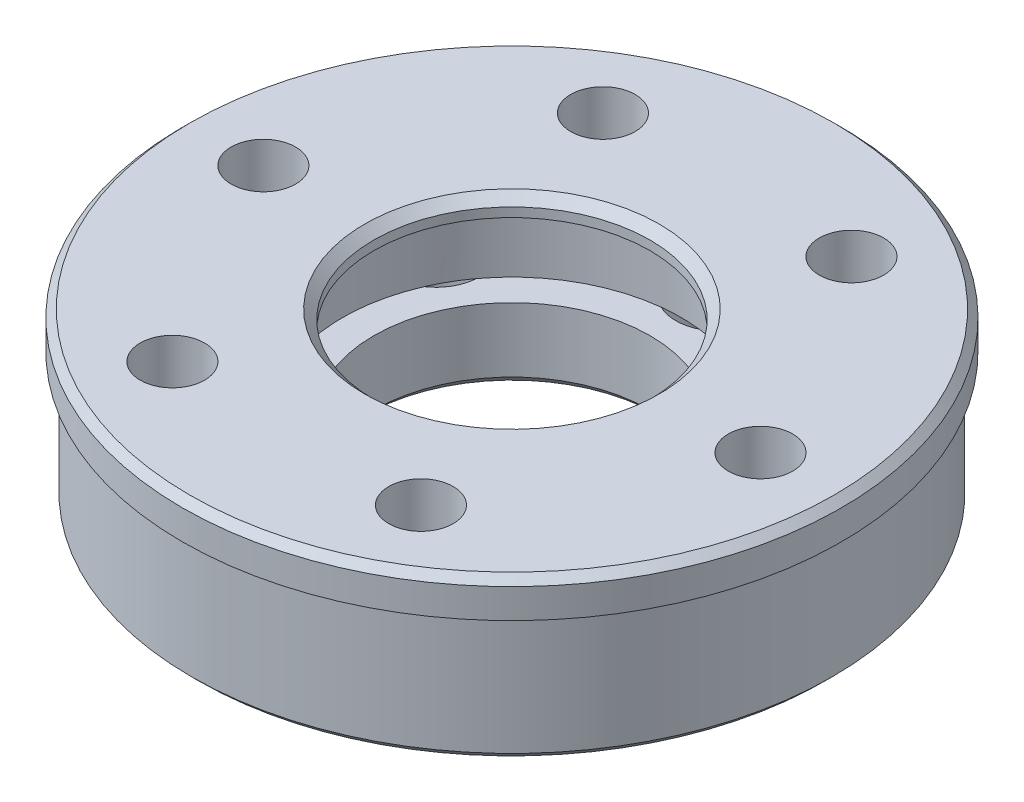
ISO-10303-21;
HEADER;
FILE_DESCRIPTION(('STEP AP214'),'2;1');
FILE_NAME('part.step','',(''),(''),'','','');
FILE_SCHEMA(('AUTOMOTIVE_DESIGN { 1 0 10303 214 1 1 1 1 }'));
ENDSEC;
DATA;
#1=APPLICATION_CONTEXT('core data for automotive mechanical design processes');
#2=APPLICATION_PROTOCOL_DEFINITION('international standard','automotive_design',2000,#1);
#3=PRODUCT_CONTEXT('',#1,'mechanical');
#4=PRODUCT('Part','Part','',(#3));
#5=PRODUCT_RELATED_PRODUCT_CATEGORY('part','',(#4));
#6=PRODUCT_DEFINITION_FORMATION('','',#4);
#7=PRODUCT_DEFINITION_CONTEXT('part definition',#1,'design');
#8=PRODUCT_DEFINITION('design','',#6,#7);
#9=PRODUCT_DEFINITION_SHAPE('','',#8);
#10=(LENGTH_UNIT() NAMED_UNIT(*) SI_UNIT(.MILLI.,.METRE.));
#11=(NAMED_UNIT(*) PLANE_ANGLE_UNIT() SI_UNIT($,.RADIAN.));
#12=(NAMED_UNIT(*) SI_UNIT($,.STERADIAN.) SOLID_ANGLE_UNIT());
#13=UNCERTAINTY_MEASURE_WITH_UNIT(LENGTH_MEASURE(1.E-05),#10,'distance_accuracy_value','');
#14=(GEOMETRIC_REPRESENTATION_CONTEXT(3) GLOBAL_UNCERTAINTY_ASSIGNED_CONTEXT((#13)) GLOBAL_UNIT_ASSIGNED_CONTEXT((#10,
#11,#12)) REPRESENTATION_CONTEXT('',''));
#15=CARTESIAN_POINT('',(0.,0.,0.));
#16=DIRECTION('',(0.,0.,1.));
#17=DIRECTION('',(1.,0.,0.));
#18=AXIS2_PLACEMENT_3D('',#15,#16,#17);
#19=CARTESIAN_POINT('',(0.,4.5,0.));
#20=DIRECTION('',(0.,-1.,0.));
#21=DIRECTION('',(0.,0.,-1.));
#22=AXIS2_PLACEMENT_3D('',#19,#20,#21);
#23=CYLINDRICAL_SURFACE('',#22,17.4);
#24=CARTESIAN_POINT('',(0.,-4.1,0.));
#25=DIRECTION('',(0.,1.,0.));
#26=DIRECTION('',(0.,0.,1.));
#27=AXIS2_PLACEMENT_3D('',#24,#25,#26);
#28=CIRCLE('',#27,17.4);
#29=CARTESIAN_POINT('',(0.,-4.1,17.4));
#30=VERTEX_POINT('',#29);
#31=EDGE_CURVE('E48',#30,#30,#28,.T.);
#32=ORIENTED_EDGE('',*,*,#31,.T.);
#33=EDGE_LOOP('',(#32));
#34=FACE_BOUND('',#33,.T.);
#35=CARTESIAN_POINT('',(0.,2.5,0.));
#36=DIRECTION('',(0.,1.,0.));
#37=DIRECTION('',(0.,0.,1.));
#38=AXIS2_PLACEMENT_3D('',#35,#36,#37);
#39=CIRCLE('',#38,17.4);
#40=CARTESIAN_POINT('',(0.,2.5,17.4));
#41=VERTEX_POINT('',#40);
#42=EDGE_CURVE('E255',#41,#41,#39,.T.);
#43=ORIENTED_EDGE('',*,*,#42,.F.);
#44=EDGE_LOOP('',(#43));
#45=FACE_BOUND('',#44,.T.);
#46=ADVANCED_FACE('F39',(#34,#45),#23,.T.);
#47=CARTESIAN_POINT('',(13.5,4.5,0.));
#48=DIRECTION('',(0.,-1.,0.));
#49=DIRECTION('',(0.,0.,-1.));
#50=AXIS2_PLACEMENT_3D('',#47,#48,#49);
#51=CYLINDRICAL_SURFACE('',#50,1.75);
#52=CARTESIAN_POINT('',(13.5,4.5,0.));
#53=DIRECTION('',(0.,1.,0.));
#54=DIRECTION('',(0.,0.,1.));
#55=AXIS2_PLACEMENT_3D('',#52,#53,#54);
#56=CIRCLE('',#55,1.75);
#57=CARTESIAN_POINT('',(13.5,4.5,1.75));
#58=VERTEX_POINT('',#57);
#59=EDGE_CURVE('E246',#58,#58,#56,.T.);
#60=ORIENTED_EDGE('',*,*,#59,.T.);
#61=EDGE_LOOP('',(#60));
#62=FACE_BOUND('',#61,.T.);
#63=CARTESIAN_POINT('',(13.5,-3.,0.));
#64=DIRECTION('',(0.,-1.,0.));
#65=DIRECTION('',(0.,0.,-1.));
#66=AXIS2_PLACEMENT_3D('',#63,#64,#65);
#67=CIRCLE('',#66,1.75);
#68=CARTESIAN_POINT('',(13.5,-3.,-1.75));
#69=VERTEX_POINT('',#68);
#70=EDGE_CURVE('E130',#69,#69,#67,.T.);
#71=ORIENTED_EDGE('',*,*,#70,.T.);
#72=EDGE_LOOP('',(#71));
#73=FACE_BOUND('',#72,.T.);
#74=ADVANCED_FACE('F279',(#62,#73),#51,.F.);
#75=CARTESIAN_POINT('',(6.74999999999997,4.5,11.6913429510899));
#76=DIRECTION('',(0.,-1.,0.));
#77=DIRECTION('',(0.,0.,-1.));
#78=AXIS2_PLACEMENT_3D('',#75,#76,#77);
#79=CYLINDRICAL_SURFACE('',#78,1.75);
#80=CARTESIAN_POINT('',(6.74999999999997,4.5,11.6913429510899));
#81=DIRECTION('',(0.,1.,0.));
#82=DIRECTION('',(0.,0.,1.));
#83=AXIS2_PLACEMENT_3D('',#80,#81,#82);
#84=CIRCLE('',#83,1.75);
#85=CARTESIAN_POINT('',(6.74999999999997,4.5,13.4413429510899));
#86=VERTEX_POINT('',#85);
#87=EDGE_CURVE('E335',#86,#86,#84,.T.);
#88=ORIENTED_EDGE('',*,*,#87,.T.);
#89=EDGE_LOOP('',(#88));
#90=FACE_BOUND('',#89,.T.);
#91=CARTESIAN_POINT('',(6.74999999999997,-3.,11.6913429510899));
#92=DIRECTION('',(0.,-1.,0.));
#93=DIRECTION('',(0.,0.,-1.));
#94=AXIS2_PLACEMENT_3D('',#91,#92,#93);
#95=CIRCLE('',#94,1.75);
#96=CARTESIAN_POINT('',(6.74999999999997,-3.,9.94134295108994));
#97=VERTEX_POINT('',#96);
#98=EDGE_CURVE('E135',#97,#97,#95,.T.);
#99=ORIENTED_EDGE('',*,*,#98,.T.);
#100=EDGE_LOOP('',(#99));
#101=FACE_BOUND('',#100,.T.);
#102=ADVANCED_FACE('F284',(#90,#101),#79,.F.);
#103=CARTESIAN_POINT('',(-6.75000000000005,4.5,11.6913429510899));
#104=DIRECTION('',(0.,-1.,0.));
#105=DIRECTION('',(0.,0.,-1.));
#106=AXIS2_PLACEMENT_3D('',#103,#104,#105);
#107=CYLINDRICAL_SURFACE('',#106,1.75);
#108=CARTESIAN_POINT('',(-6.75000000000005,4.5,11.6913429510899));
#109=DIRECTION('',(0.,1.,0.));
#110=DIRECTION('',(0.,0.,1.));
#111=AXIS2_PLACEMENT_3D('',#108,#109,#110);
#112=CIRCLE('',#111,1.75);
#113=CARTESIAN_POINT('',(-6.75000000000005,4.5,13.4413429510899));
#114=VERTEX_POINT('',#113);
#115=EDGE_CURVE('E338',#114,#114,#112,.T.);
#116=ORIENTED_EDGE('',*,*,#115,.T.);
#117=EDGE_LOOP('',(#116));
#118=FACE_BOUND('',#117,.T.);
#119=CARTESIAN_POINT('',(-6.75000000000005,-3.,11.6913429510899));
#120=DIRECTION('',(0.,-1.,0.));
#121=DIRECTION('',(0.,0.,-1.));
#122=AXIS2_PLACEMENT_3D('',#119,#120,#121);
#123=CIRCLE('',#122,1.75);
#124=CARTESIAN_POINT('',(-6.75000000000005,-3.,9.94134295108989));
#125=VERTEX_POINT('',#124);
#126=EDGE_CURVE('E140',#125,#125,#123,.T.);
#127=ORIENTED_EDGE('',*,*,#126,.T.);
#128=EDGE_LOOP('',(#127));
#129=FACE_BOUND('',#128,.T.);
#130=ADVANCED_FACE('F397',(#118,#129),#107,.F.);
#131=CARTESIAN_POINT('',(-13.5,4.5,0.));
#132=DIRECTION('',(0.,-1.,0.));
#133=DIRECTION('',(0.,0.,-1.));
#134=AXIS2_PLACEMENT_3D('',#131,#132,#133);
#135=CYLINDRICAL_SURFACE('',#134,1.75);
#136=CARTESIAN_POINT('',(-13.5,4.5,0.));
#137=DIRECTION('',(0.,1.,0.));
#138=DIRECTION('',(0.,0.,1.));
#139=AXIS2_PLACEMENT_3D('',#136,#137,#138);
#140=CIRCLE('',#139,1.75);
#141=CARTESIAN_POINT('',(-13.5,4.5,1.74999999999991));
#142=VERTEX_POINT('',#141);
#143=EDGE_CURVE('E341',#142,#142,#140,.T.);
#144=ORIENTED_EDGE('',*,*,#143,.T.);
#145=EDGE_LOOP('',(#144));
#146=FACE_BOUND('',#145,.T.);
#147=CARTESIAN_POINT('',(-13.5,-3.,0.));
#148=DIRECTION('',(0.,-1.,0.));
#149=DIRECTION('',(0.,0.,-1.));
#150=AXIS2_PLACEMENT_3D('',#147,#148,#149);
#151=CIRCLE('',#150,1.75);
#152=CARTESIAN_POINT('',(-13.5,-3.,-1.75000000000009));
#153=VERTEX_POINT('',#152);
#154=EDGE_CURVE('E145',#153,#153,#151,.T.);
#155=ORIENTED_EDGE('',*,*,#154,.T.);
#156=EDGE_LOOP('',(#155));
#157=FACE_BOUND('',#156,.T.);
#158=ADVANCED_FACE('F403',(#146,#157),#135,.F.);
#159=CARTESIAN_POINT('',(-6.74999999999989,4.5,-11.69134295109));
#160=DIRECTION('',(0.,-1.,0.));
#161=DIRECTION('',(0.,0.,-1.));
#162=AXIS2_PLACEMENT_3D('',#159,#160,#161);
#163=CYLINDRICAL_SURFACE('',#162,1.75);
#164=CARTESIAN_POINT('',(-6.74999999999989,4.5,-11.69134295109));
#165=DIRECTION('',(0.,1.,0.));
#166=DIRECTION('',(0.,0.,1.));
#167=AXIS2_PLACEMENT_3D('',#164,#165,#166);
#168=CIRCLE('',#167,1.75);
#169=CARTESIAN_POINT('',(-6.74999999999989,4.5,-9.94134295108998));
#170=VERTEX_POINT('',#169);
#171=EDGE_CURVE('E329',#170,#170,#168,.T.);
#172=ORIENTED_EDGE('',*,*,#171,.T.);
#173=EDGE_LOOP('',(#172));
#174=FACE_BOUND('',#173,.T.);
#175=CARTESIAN_POINT('',(-6.74999999999989,-3.,-11.69134295109));
#176=DIRECTION('',(0.,-1.,0.));
#177=DIRECTION('',(0.,0.,-1.));
#178=AXIS2_PLACEMENT_3D('',#175,#176,#177);
#179=CIRCLE('',#178,1.75);
#180=CARTESIAN_POINT('',(-6.74999999999989,-3.,-13.44134295109));
#181=VERTEX_POINT('',#180);
#182=EDGE_CURVE('E148',#181,#181,#179,.T.);
#183=ORIENTED_EDGE('',*,*,#182,.T.);
#184=EDGE_LOOP('',(#183));
#185=FACE_BOUND('',#184,.T.);
#186=ADVANCED_FACE('F347',(#174,#185),#163,.F.);
#187=CARTESIAN_POINT('',(6.75000000000014,4.5,-11.6913429510898));
#188=DIRECTION('',(0.,-1.,0.));
#189=DIRECTION('',(0.,0.,-1.));
#190=AXIS2_PLACEMENT_3D('',#187,#188,#189);
#191=CYLINDRICAL_SURFACE('',#190,1.75);
#192=CARTESIAN_POINT('',(6.75000000000014,4.5,-11.6913429510898));
#193=DIRECTION('',(0.,1.,0.));
#194=DIRECTION('',(0.,0.,1.));
#195=AXIS2_PLACEMENT_3D('',#192,#193,#194);
#196=CIRCLE('',#195,1.75);
#197=CARTESIAN_POINT('',(6.75000000000014,4.5,-9.94134295108984));
#198=VERTEX_POINT('',#197);
#199=EDGE_CURVE('E327',#198,#198,#196,.T.);
#200=ORIENTED_EDGE('',*,*,#199,.T.);
#201=EDGE_LOOP('',(#200));
#202=FACE_BOUND('',#201,.T.);
#203=CARTESIAN_POINT('',(6.75000000000014,-3.,-11.6913429510898));
#204=DIRECTION('',(0.,-1.,0.));
#205=DIRECTION('',(0.,0.,-1.));
#206=AXIS2_PLACEMENT_3D('',#203,#204,#205);
#207=CIRCLE('',#206,1.75);
#208=CARTESIAN_POINT('',(6.75000000000014,-3.,-13.4413429510898));
#209=VERTEX_POINT('',#208);
#210=EDGE_CURVE('E240',#209,#209,#207,.T.);
#211=ORIENTED_EDGE('',*,*,#210,.T.);
#212=EDGE_LOOP('',(#211));
#213=FACE_BOUND('',#212,.T.);
#214=ADVANCED_FACE('F363',(#202,#213),#191,.F.);
#215=CARTESIAN_POINT('',(0.,4.5,0.));
#216=DIRECTION('',(0.,-1.,0.));
#217=DIRECTION('',(0.,0.,-1.));
#218=AXIS2_PLACEMENT_3D('',#215,#216,#217);
#219=CYLINDRICAL_SURFACE('',#218,7.5);
#220=CARTESIAN_POINT('',(0.,-4.,0.));
#221=DIRECTION('',(0.,1.,0.));
#222=DIRECTION('',(0.,0.,1.));
#223=AXIS2_PLACEMENT_3D('',#220,#221,#222);
#224=CIRCLE('',#223,7.5);
#225=CARTESIAN_POINT('',(0.,-4.,7.5));
#226=VERTEX_POINT('',#225);
#227=EDGE_CURVE('E239',#226,#226,#224,.F.);
#228=ORIENTED_EDGE('',*,*,#227,.T.);
#229=EDGE_LOOP('',(#228));
#230=FACE_BOUND('',#229,.T.);
#231=CARTESIAN_POINT('',(0.,-0.5,0.));
#232=DIRECTION('',(0.,1.,0.));
#233=DIRECTION('',(0.,0.,1.));
#234=AXIS2_PLACEMENT_3D('',#231,#232,#233);
#235=CIRCLE('',#234,7.5);
#236=CARTESIAN_POINT('',(0.,-0.5,7.5));
#237=VERTEX_POINT('',#236);
#238=EDGE_CURVE('E125',#237,#237,#235,.T.);
#239=ORIENTED_EDGE('',*,*,#238,.T.);
#240=EDGE_LOOP('',(#239));
#241=FACE_BOUND('',#240,.T.);
#242=ADVANCED_FACE('F322',(#230,#241),#219,.F.);
#243=CARTESIAN_POINT('',(0.,4.5,0.));
#244=DIRECTION('',(0.,1.,0.));
#245=DIRECTION('',(0.,0.,1.));
#246=AXIS2_PLACEMENT_3D('',#243,#244,#245);
#247=PLANE('',#246);
#248=CARTESIAN_POINT('',(0.,4.5,0.));
#249=DIRECTION('',(0.,1.,0.));
#250=DIRECTION('',(0.,0.,1.));
#251=AXIS2_PLACEMENT_3D('',#248,#249,#250);
#252=CIRCLE('',#251,17.5);
#253=CARTESIAN_POINT('',(0.,4.5,17.5));
#254=VERTEX_POINT('',#253);
#255=EDGE_CURVE('E259',#254,#254,#252,.T.);
#256=ORIENTED_EDGE('',*,*,#255,.T.);
#257=EDGE_LOOP('',(#256));
#258=FACE_BOUND('',#257,.T.);
#259=CARTESIAN_POINT('',(0.,4.5,0.));
#260=DIRECTION('',(0.,1.,0.));
#261=DIRECTION('',(0.,0.,1.));
#262=AXIS2_PLACEMENT_3D('',#259,#260,#261);
#263=CIRCLE('',#262,8.00000000000001);
#264=CARTESIAN_POINT('',(0.,4.5,8.00000000000001));
#265=VERTEX_POINT('',#264);
#266=EDGE_CURVE('E252',#265,#265,#263,.F.);
#267=ORIENTED_EDGE('',*,*,#266,.T.);
#268=EDGE_LOOP('',(#267));
#269=FACE_BOUND('',#268,.T.);
#270=ORIENTED_EDGE('',*,*,#171,.F.);
#271=EDGE_LOOP('',(#270));
#272=FACE_BOUND('',#271,.T.);
#273=ORIENTED_EDGE('',*,*,#115,.F.);
#274=EDGE_LOOP('',(#273));
#275=FACE_BOUND('',#274,.T.);
#276=ORIENTED_EDGE('',*,*,#59,.F.);
#277=EDGE_LOOP('',(#276));
#278=FACE_BOUND('',#277,.T.);
#279=ORIENTED_EDGE('',*,*,#87,.F.);
#280=EDGE_LOOP('',(#279));
#281=FACE_BOUND('',#280,.T.);
#282=ORIENTED_EDGE('',*,*,#143,.F.);
#283=EDGE_LOOP('',(#282));
#284=FACE_BOUND('',#283,.T.);
#285=ORIENTED_EDGE('',*,*,#199,.F.);
#286=EDGE_LOOP('',(#285));
#287=FACE_BOUND('',#286,.T.);
#288=ADVANCED_FACE('F224',(#258,#269,#272,#275,#278,#281,#284,#287),#247,.T.);
#289=CARTESIAN_POINT('',(0.,-4.5,0.));
#290=DIRECTION('',(0.,1.,0.));
#291=DIRECTION('',(0.,0.,1.));
#292=AXIS2_PLACEMENT_3D('',#289,#290,#291);
#293=PLANE('',#292);
#294=CARTESIAN_POINT('',(0.,-4.5,0.));
#295=DIRECTION('',(0.,1.,0.));
#296=DIRECTION('',(0.,0.,1.));
#297=AXIS2_PLACEMENT_3D('',#294,#295,#296);
#298=CIRCLE('',#297,17.);
#299=CARTESIAN_POINT('',(0.,-4.5,17.));
#300=VERTEX_POINT('',#299);
#301=EDGE_CURVE('E11',#300,#300,#298,.F.);
#302=ORIENTED_EDGE('',*,*,#301,.T.);
#303=EDGE_LOOP('',(#302));
#304=FACE_BOUND('',#303,.T.);
#305=CARTESIAN_POINT('',(0.,-4.5,11.25));
#306=DIRECTION('',(0.,-1.,0.));
#307=DIRECTION('',(0.,0.,-1.));
#308=AXIS2_PLACEMENT_3D('',#305,#306,#307);
#309=CIRCLE('',#308,2.35);
#310=CARTESIAN_POINT('',(0.,-4.5,8.9));
#311=VERTEX_POINT('',#310);
#312=EDGE_CURVE('E156',#311,#311,#309,.T.);
#313=ORIENTED_EDGE('',*,*,#312,.F.);
#314=EDGE_LOOP('',(#313));
#315=FACE_BOUND('',#314,.T.);
#316=CARTESIAN_POINT('',(-9.74278579257495,-4.5,5.62499999999998));
#317=DIRECTION('',(0.,-1.,0.));
#318=DIRECTION('',(0.,0.,-1.));
#319=AXIS2_PLACEMENT_3D('',#316,#317,#318);
#320=CIRCLE('',#319,2.35);
#321=CARTESIAN_POINT('',(-9.74278579257495,-4.5,3.27499999999998));
#322=VERTEX_POINT('',#321);
#323=EDGE_CURVE('E161',#322,#322,#320,.T.);
#324=ORIENTED_EDGE('',*,*,#323,.F.);
#325=EDGE_LOOP('',(#324));
#326=FACE_BOUND('',#325,.T.);
#327=CARTESIAN_POINT('',(-9.74278579257493,-4.5,-5.62500000000002));
#328=DIRECTION('',(0.,-1.,0.));
#329=DIRECTION('',(0.,0.,-1.));
#330=AXIS2_PLACEMENT_3D('',#327,#328,#329);
#331=CIRCLE('',#330,2.35);
#332=CARTESIAN_POINT('',(-9.74278579257493,-4.5,-7.97500000000002));
#333=VERTEX_POINT('',#332);
#334=EDGE_CURVE('E167',#333,#333,#331,.T.);
#335=ORIENTED_EDGE('',*,*,#334,.F.);
#336=EDGE_LOOP('',(#335));
#337=FACE_BOUND('',#336,.T.);
#338=CARTESIAN_POINT('',(0.,-4.5,-11.25));
#339=DIRECTION('',(0.,-1.,0.));
#340=DIRECTION('',(0.,0.,-1.));
#341=AXIS2_PLACEMENT_3D('',#338,#339,#340);
#342=CIRCLE('',#341,2.35);
#343=CARTESIAN_POINT('',(0.,-4.5,-13.6));
#344=VERTEX_POINT('',#343);
#345=EDGE_CURVE('E173',#344,#344,#342,.T.);
#346=ORIENTED_EDGE('',*,*,#345,.F.);
#347=EDGE_LOOP('',(#346));
#348=FACE_BOUND('',#347,.T.);
#349=CARTESIAN_POINT('',(9.74278579257494,-4.5,-5.62499999999998));
#350=DIRECTION('',(0.,-1.,0.));
#351=DIRECTION('',(0.,0.,-1.));
#352=AXIS2_PLACEMENT_3D('',#349,#350,#351);
#353=CIRCLE('',#352,2.35);
#354=CARTESIAN_POINT('',(9.74278579257494,-4.5,-7.97499999999998));
#355=VERTEX_POINT('',#354);
#356=EDGE_CURVE('E180',#355,#355,#353,.T.);
#357=ORIENTED_EDGE('',*,*,#356,.F.);
#358=EDGE_LOOP('',(#357));
#359=FACE_BOUND('',#358,.T.);
#360=CARTESIAN_POINT('',(9.74278579257493,-4.5,5.62500000000001));
#361=DIRECTION('',(0.,-1.,0.));
#362=DIRECTION('',(0.,0.,-1.));
#363=AXIS2_PLACEMENT_3D('',#360,#361,#362);
#364=CIRCLE('',#363,2.35);
#365=CARTESIAN_POINT('',(9.74278579257493,-4.5,3.27500000000001));
#366=VERTEX_POINT('',#365);
#367=EDGE_CURVE('E100',#366,#366,#364,.T.);
#368=ORIENTED_EDGE('',*,*,#367,.F.);
#369=EDGE_LOOP('',(#368));
#370=FACE_BOUND('',#369,.T.);
#371=CARTESIAN_POINT('',(0.,-4.5,0.));
#372=DIRECTION('',(0.,1.,0.));
#373=DIRECTION('',(0.,0.,1.));
#374=AXIS2_PLACEMENT_3D('',#371,#372,#373);
#375=CIRCLE('',#374,8.);
#376=CARTESIAN_POINT('',(0.,-4.5,8.));
#377=VERTEX_POINT('',#376);
#378=EDGE_CURVE('E237',#377,#377,#375,.T.);
#379=ORIENTED_EDGE('',*,*,#378,.T.);
#380=EDGE_LOOP('',(#379));
#381=FACE_BOUND('',#380,.T.);
#382=ADVANCED_FACE('F220',(#304,#315,#326,#337,#348,#359,#370,#381),#293,.F.);
#383=CARTESIAN_POINT('',(0.,3.99999999999999,0.));
#384=DIRECTION('',(0.,1.,0.));
#385=DIRECTION('',(0.,0.,1.));
#386=AXIS2_PLACEMENT_3D('',#383,#384,#385);
#387=CIRCLE('',#386,7.5);
#388=CARTESIAN_POINT('',(0.,3.99999999999999,7.5));
#389=VERTEX_POINT('',#388);
#390=EDGE_CURVE('E243',#389,#389,#387,.T.);
#391=ORIENTED_EDGE('',*,*,#390,.T.);
#392=EDGE_LOOP('',(#391));
#393=FACE_BOUND('',#392,.T.);
#394=CARTESIAN_POINT('',(0.,3.5,0.));
#395=DIRECTION('',(0.,1.,0.));
#396=DIRECTION('',(0.,0.,1.));
#397=AXIS2_PLACEMENT_3D('',#394,#395,#396);
#398=CIRCLE('',#397,7.5);
#399=CARTESIAN_POINT('',(0.,3.5,7.5));
#400=VERTEX_POINT('',#399);
#401=EDGE_CURVE('E325',#400,#400,#398,.T.);
#402=ORIENTED_EDGE('',*,*,#401,.F.);
#403=EDGE_LOOP('',(#402));
#404=FACE_BOUND('',#403,.T.);
#405=ADVANCED_FACE('F223',(#393,#404),#219,.F.);
#406=CARTESIAN_POINT('',(0.,3.5,0.));
#407=DIRECTION('',(0.,-1.,0.));
#408=DIRECTION('',(0.,0.,-1.));
#409=AXIS2_PLACEMENT_3D('',#406,#407,#408);
#410=CYLINDRICAL_SURFACE('',#409,9.2);
#411=CARTESIAN_POINT('',(0.,3.5,0.));
#412=DIRECTION('',(0.,1.,0.));
#413=DIRECTION('',(0.,0.,1.));
#414=AXIS2_PLACEMENT_3D('',#411,#412,#413);
#415=CIRCLE('',#414,9.2);
#416=CARTESIAN_POINT('',(0.,3.5,9.2));
#417=VERTEX_POINT('',#416);
#418=EDGE_CURVE('E122',#417,#417,#415,.T.);
#419=ORIENTED_EDGE('',*,*,#418,.T.);
#420=EDGE_LOOP('',(#419));
#421=FACE_BOUND('',#420,.T.);
#422=CARTESIAN_POINT('',(0.,-0.5,0.));
#423=DIRECTION('',(0.,1.,0.));
#424=DIRECTION('',(0.,0.,1.));
#425=AXIS2_PLACEMENT_3D('',#422,#423,#424);
#426=CIRCLE('',#425,9.2);
#427=CARTESIAN_POINT('',(1.03731619523116,-0.5,9.14133333333334));
#428=VERTEX_POINT('',#427);
#429=CARTESIAN_POINT('',(7.39796879351255,-0.5,5.4690088434939));
#430=VERTEX_POINT('',#429);
#431=EDGE_CURVE('E113',#428,#430,#426,.T.);
#432=ORIENTED_EDGE('',*,*,#431,.F.);
#433=CARTESIAN_POINT('',(-1.0373161952312,-0.5,9.14133333333333));
#434=VERTEX_POINT('',#433);
#435=EDGE_CURVE('E123',#434,#428,#426,.T.);
#436=ORIENTED_EDGE('',*,*,#435,.F.);
#437=CARTESIAN_POINT('',(-7.39796879351257,-0.5,5.46900884349387));
#438=VERTEX_POINT('',#437);
#439=EDGE_CURVE('E129',#438,#434,#426,.T.);
#440=ORIENTED_EDGE('',*,*,#439,.F.);
#441=CARTESIAN_POINT('',(-8.43528498874375,-0.5,3.67232448983943));
#442=VERTEX_POINT('',#441);
#443=EDGE_CURVE('E133',#442,#438,#426,.T.);
#444=ORIENTED_EDGE('',*,*,#443,.F.);
#445=CARTESIAN_POINT('',(-8.43528498874373,-0.5,-3.67232448983946));
#446=VERTEX_POINT('',#445);
#447=EDGE_CURVE('E204',#446,#442,#426,.T.);
#448=ORIENTED_EDGE('',*,*,#447,.F.);
#449=CARTESIAN_POINT('',(-7.39796879351255,-0.5,-5.4690088434939));
#450=VERTEX_POINT('',#449);
#451=EDGE_CURVE('E202',#450,#446,#426,.T.);
#452=ORIENTED_EDGE('',*,*,#451,.F.);
#453=CARTESIAN_POINT('',(-1.03731619523117,-0.5,-9.14133333333334));
#454=VERTEX_POINT('',#453);
#455=EDGE_CURVE('E199',#454,#450,#426,.T.);
#456=ORIENTED_EDGE('',*,*,#455,.F.);
#457=CARTESIAN_POINT('',(1.0373161952312,-0.5,-9.14133333333333));
#458=VERTEX_POINT('',#457);
#459=EDGE_CURVE('E197',#458,#454,#426,.T.);
#460=ORIENTED_EDGE('',*,*,#459,.F.);
#461=CARTESIAN_POINT('',(7.39796879351257,-0.5,-5.46900884349388));
#462=VERTEX_POINT('',#461);
#463=EDGE_CURVE('E196',#462,#458,#426,.T.);
#464=ORIENTED_EDGE('',*,*,#463,.F.);
#465=CARTESIAN_POINT('',(8.43528498874374,-0.5,-3.67232448983943));
#466=VERTEX_POINT('',#465);
#467=EDGE_CURVE('E191',#466,#462,#426,.T.);
#468=ORIENTED_EDGE('',*,*,#467,.F.);
#469=CARTESIAN_POINT('',(8.43528498874373,-0.5,3.67232448983946));
#470=VERTEX_POINT('',#469);
#471=EDGE_CURVE('E115',#470,#466,#426,.T.);
#472=ORIENTED_EDGE('',*,*,#471,.F.);
#473=EDGE_CURVE('E96',#430,#470,#426,.T.);
#474=ORIENTED_EDGE('',*,*,#473,.F.);
#475=EDGE_LOOP('',(#432,#436,#440,#444,#448,#452,#456,#460,#464,#468,#472,#474));
#476=FACE_BOUND('',#475,.T.);
#477=ADVANCED_FACE('F111',(#421,#476),#410,.F.);
#478=CARTESIAN_POINT('',(0.,3.5,0.));
#479=DIRECTION('',(0.,1.,0.));
#480=DIRECTION('',(0.,0.,1.));
#481=AXIS2_PLACEMENT_3D('',#478,#479,#480);
#482=PLANE('',#481);
#483=ORIENTED_EDGE('',*,*,#401,.T.);
#484=EDGE_LOOP('',(#483));
#485=FACE_BOUND('',#484,.T.);
#486=ORIENTED_EDGE('',*,*,#418,.F.);
#487=EDGE_LOOP('',(#486));
#488=FACE_BOUND('',#487,.T.);
#489=ADVANCED_FACE('F379',(#485,#488),#482,.F.);
#490=CARTESIAN_POINT('',(0.,-0.5,0.));
#491=DIRECTION('',(0.,1.,0.));
#492=DIRECTION('',(0.,0.,1.));
#493=AXIS2_PLACEMENT_3D('',#490,#491,#492);
#494=PLANE('',#493);
#495=CARTESIAN_POINT('',(0.,-0.5,11.25));
#496=DIRECTION('',(0.,1.,0.));
#497=DIRECTION('',(0.,0.,1.));
#498=AXIS2_PLACEMENT_3D('',#495,#496,#497);
#499=CIRCLE('',#498,2.35);
#500=EDGE_CURVE('E121',#428,#434,#499,.T.);
#501=ORIENTED_EDGE('',*,*,#500,.F.);
#502=ORIENTED_EDGE('',*,*,#431,.T.);
#503=CARTESIAN_POINT('',(9.74278579257493,-0.5,5.62500000000001));
#504=DIRECTION('',(0.,-1.,0.));
#505=DIRECTION('',(0.,0.,-1.));
#506=AXIS2_PLACEMENT_3D('',#503,#504,#505);
#507=CIRCLE('',#506,2.35);
#508=EDGE_CURVE('E99',#430,#470,#507,.T.);
#509=ORIENTED_EDGE('',*,*,#508,.T.);
#510=ORIENTED_EDGE('',*,*,#471,.T.);
#511=CARTESIAN_POINT('',(9.74278579257494,-0.5,-5.62499999999998));
#512=DIRECTION('',(0.,-1.,0.));
#513=DIRECTION('',(0.,0.,-1.));
#514=AXIS2_PLACEMENT_3D('',#511,#512,#513);
#515=CIRCLE('',#514,2.35);
#516=EDGE_CURVE('E154',#466,#462,#515,.T.);
#517=ORIENTED_EDGE('',*,*,#516,.T.);
#518=ORIENTED_EDGE('',*,*,#463,.T.);
#519=CARTESIAN_POINT('',(0.,-0.5,-11.25));
#520=DIRECTION('',(0.,-1.,0.));
#521=DIRECTION('',(0.,0.,-1.));
#522=AXIS2_PLACEMENT_3D('',#519,#520,#521);
#523=CIRCLE('',#522,2.35);
#524=EDGE_CURVE('E177',#458,#454,#523,.T.);
#525=ORIENTED_EDGE('',*,*,#524,.T.);
#526=ORIENTED_EDGE('',*,*,#455,.T.);
#527=CARTESIAN_POINT('',(-9.74278579257493,-0.5,-5.62500000000002));
#528=DIRECTION('',(0.,-1.,0.));
#529=DIRECTION('',(0.,0.,-1.));
#530=AXIS2_PLACEMENT_3D('',#527,#528,#529);
#531=CIRCLE('',#530,2.35);
#532=EDGE_CURVE('E170',#450,#446,#531,.T.);
#533=ORIENTED_EDGE('',*,*,#532,.T.);
#534=ORIENTED_EDGE('',*,*,#447,.T.);
#535=CARTESIAN_POINT('',(-9.74278579257495,-0.5,5.62499999999998));
#536=DIRECTION('',(0.,-1.,0.));
#537=DIRECTION('',(0.,0.,-1.));
#538=AXIS2_PLACEMENT_3D('',#535,#536,#537);
#539=CIRCLE('',#538,2.35);
#540=EDGE_CURVE('E164',#442,#438,#539,.T.);
#541=ORIENTED_EDGE('',*,*,#540,.T.);
#542=ORIENTED_EDGE('',*,*,#439,.T.);
#543=EDGE_LOOP('',(#501,#502,#509,#510,#517,#518,#525,#526,#533,#534,#541,#542));
#544=FACE_BOUND('',#543,.T.);
#545=ORIENTED_EDGE('',*,*,#238,.F.);
#546=EDGE_LOOP('',(#545));
#547=FACE_BOUND('',#546,.T.);
#548=ADVANCED_FACE('F118',(#544,#547),#494,.T.);
#549=CARTESIAN_POINT('',(0.,-3.,0.));
#550=DIRECTION('',(0.,-1.,0.));
#551=DIRECTION('',(0.,0.,-1.));
#552=AXIS2_PLACEMENT_3D('',#549,#550,#551);
#553=PLANE('',#552);
#554=ORIENTED_EDGE('',*,*,#210,.F.);
#555=EDGE_LOOP('',(#554));
#556=FACE_BOUND('',#555,.T.);
#557=ADVANCED_FACE('F369',(#556),#553,.F.);
#558=ORIENTED_EDGE('',*,*,#182,.F.);
#559=EDGE_LOOP('',(#558));
#560=FACE_BOUND('',#559,.T.);
#561=ADVANCED_FACE('F371',(#560),#553,.F.);
#562=ORIENTED_EDGE('',*,*,#154,.F.);
#563=EDGE_LOOP('',(#562));
#564=FACE_BOUND('',#563,.T.);
#565=ADVANCED_FACE('F377',(#564),#553,.F.);
#566=ORIENTED_EDGE('',*,*,#126,.F.);
#567=EDGE_LOOP('',(#566));
#568=FACE_BOUND('',#567,.T.);
#569=ADVANCED_FACE('F388',(#568),#553,.F.);
#570=ORIENTED_EDGE('',*,*,#98,.F.);
#571=EDGE_LOOP('',(#570));
#572=FACE_BOUND('',#571,.T.);
#573=ADVANCED_FACE('F383',(#572),#553,.F.);
#574=ORIENTED_EDGE('',*,*,#70,.F.);
#575=EDGE_LOOP('',(#574));
#576=FACE_BOUND('',#575,.T.);
#577=ADVANCED_FACE('F297',(#576),#553,.F.);
#578=CARTESIAN_POINT('',(0.,-4.5,0.));
#579=DIRECTION('',(0.,-1.,0.));
#580=DIRECTION('',(0.,0.,-1.));
#581=AXIS2_PLACEMENT_3D('',#578,#579,#580);
#582=CONICAL_SURFACE('',#581,8.,0.785398163397447);
#583=ORIENTED_EDGE('',*,*,#227,.F.);
#584=EDGE_LOOP('',(#583));
#585=FACE_BOUND('',#584,.T.);
#586=ORIENTED_EDGE('',*,*,#378,.F.);
#587=EDGE_LOOP('',(#586));
#588=FACE_BOUND('',#587,.T.);
#589=ADVANCED_FACE('F290',(#585,#588),#582,.F.);
#590=CARTESIAN_POINT('',(0.,3.99999999999999,0.));
#591=DIRECTION('',(0.,1.,0.));
#592=DIRECTION('',(0.,0.,1.));
#593=AXIS2_PLACEMENT_3D('',#590,#591,#592);
#594=CONICAL_SURFACE('',#593,7.5,0.785398163397456);
#595=ORIENTED_EDGE('',*,*,#266,.F.);
#596=EDGE_LOOP('',(#595));
#597=FACE_BOUND('',#596,.T.);
#598=ORIENTED_EDGE('',*,*,#390,.F.);
#599=EDGE_LOOP('',(#598));
#600=FACE_BOUND('',#599,.T.);
#601=ADVANCED_FACE('F296',(#597,#600),#594,.F.);
#602=CARTESIAN_POINT('',(0.,2.5,0.));
#603=DIRECTION('',(0.,1.,0.));
#604=DIRECTION('',(0.,0.,1.));
#605=AXIS2_PLACEMENT_3D('',#602,#603,#604);
#606=CYLINDRICAL_SURFACE('',#605,17.9);
#607=CARTESIAN_POINT('',(0.,4.10000000000002,0.));
#608=DIRECTION('',(0.,1.,0.));
#609=DIRECTION('',(0.,0.,1.));
#610=AXIS2_PLACEMENT_3D('',#607,#608,#609);
#611=CIRCLE('',#610,17.9);
#612=CARTESIAN_POINT('',(0.,4.10000000000002,17.9));
#613=VERTEX_POINT('',#612);
#614=EDGE_CURVE('E262',#613,#613,#611,.F.);
#615=ORIENTED_EDGE('',*,*,#614,.T.);
#616=EDGE_LOOP('',(#615));
#617=FACE_BOUND('',#616,.T.);
#618=CARTESIAN_POINT('',(0.,2.5,0.));
#619=DIRECTION('',(0.,1.,0.));
#620=DIRECTION('',(0.,0.,1.));
#621=AXIS2_PLACEMENT_3D('',#618,#619,#620);
#622=CIRCLE('',#621,17.9);
#623=CARTESIAN_POINT('',(0.,2.5,17.9));
#624=VERTEX_POINT('',#623);
#625=EDGE_CURVE('E108',#624,#624,#622,.T.);
#626=ORIENTED_EDGE('',*,*,#625,.T.);
#627=EDGE_LOOP('',(#626));
#628=FACE_BOUND('',#627,.T.);
#629=ADVANCED_FACE('F303',(#617,#628),#606,.T.);
#630=CARTESIAN_POINT('',(0.,2.5,0.));
#631=DIRECTION('',(0.,1.,0.));
#632=DIRECTION('',(0.,0.,1.));
#633=AXIS2_PLACEMENT_3D('',#630,#631,#632);
#634=PLANE('',#633);
#635=ORIENTED_EDGE('',*,*,#42,.T.);
#636=EDGE_LOOP('',(#635));
#637=FACE_BOUND('',#636,.T.);
#638=ORIENTED_EDGE('',*,*,#625,.F.);
#639=EDGE_LOOP('',(#638));
#640=FACE_BOUND('',#639,.T.);
#641=ADVANCED_FACE('F312',(#637,#640),#634,.F.);
#642=CARTESIAN_POINT('',(9.74278579257493,-0.5,5.62500000000001));
#643=DIRECTION('',(0.,-1.,0.));
#644=DIRECTION('',(0.,0.,-1.));
#645=AXIS2_PLACEMENT_3D('',#642,#643,#644);
#646=CYLINDRICAL_SURFACE('',#645,2.35);
#647=ORIENTED_EDGE('',*,*,#508,.F.);
#648=EDGE_CURVE('E92',#470,#430,#507,.T.);
#649=ORIENTED_EDGE('',*,*,#648,.F.);
#650=EDGE_LOOP('',(#647,#649));
#651=FACE_BOUND('',#650,.T.);
#652=ORIENTED_EDGE('',*,*,#367,.T.);
#653=EDGE_LOOP('',(#652));
#654=FACE_BOUND('',#653,.T.);
#655=ADVANCED_FACE('F102',(#651,#654),#646,.F.);
#656=CARTESIAN_POINT('',(9.74278579257493,-0.5,5.62500000000001));
#657=DIRECTION('',(0.,-1.,0.));
#658=DIRECTION('',(0.,0.,-1.));
#659=AXIS2_PLACEMENT_3D('',#656,#657,#658);
#660=PLANE('',#659);
#661=ORIENTED_EDGE('',*,*,#648,.T.);
#662=ORIENTED_EDGE('',*,*,#473,.T.);
#663=EDGE_LOOP('',(#661,#662));
#664=FACE_BOUND('',#663,.T.);
#665=ADVANCED_FACE('F94',(#664),#660,.T.);
#666=CARTESIAN_POINT('',(9.74278579257494,-0.5,-5.62499999999998));
#667=DIRECTION('',(0.,-1.,0.));
#668=DIRECTION('',(0.,0.,-1.));
#669=AXIS2_PLACEMENT_3D('',#666,#667,#668);
#670=CYLINDRICAL_SURFACE('',#669,2.35);
#671=ORIENTED_EDGE('',*,*,#516,.F.);
#672=EDGE_CURVE('E183',#462,#466,#515,.T.);
#673=ORIENTED_EDGE('',*,*,#672,.F.);
#674=EDGE_LOOP('',(#671,#673));
#675=FACE_BOUND('',#674,.T.);
#676=ORIENTED_EDGE('',*,*,#356,.T.);
#677=EDGE_LOOP('',(#676));
#678=FACE_BOUND('',#677,.T.);
#679=ADVANCED_FACE('F193',(#675,#678),#670,.F.);
#680=CARTESIAN_POINT('',(9.74278579257494,-0.5,-5.62499999999998));
#681=DIRECTION('',(0.,-1.,0.));
#682=DIRECTION('',(0.,0.,-1.));
#683=AXIS2_PLACEMENT_3D('',#680,#681,#682);
#684=PLANE('',#683);
#685=ORIENTED_EDGE('',*,*,#672,.T.);
#686=ORIENTED_EDGE('',*,*,#467,.T.);
#687=EDGE_LOOP('',(#685,#686));
#688=FACE_BOUND('',#687,.T.);
#689=ADVANCED_FACE('F190',(#688),#684,.T.);
#690=CARTESIAN_POINT('',(0.,-0.5,-11.25));
#691=DIRECTION('',(0.,-1.,0.));
#692=DIRECTION('',(0.,0.,-1.));
#693=AXIS2_PLACEMENT_3D('',#690,#691,#692);
#694=CYLINDRICAL_SURFACE('',#693,2.35);
#695=ORIENTED_EDGE('',*,*,#524,.F.);
#696=EDGE_CURVE('E176',#454,#458,#523,.T.);
#697=ORIENTED_EDGE('',*,*,#696,.F.);
#698=EDGE_LOOP('',(#695,#697));
#699=FACE_BOUND('',#698,.T.);
#700=ORIENTED_EDGE('',*,*,#345,.T.);
#701=EDGE_LOOP('',(#700));
#702=FACE_BOUND('',#701,.T.);
#703=ADVANCED_FACE('F469',(#699,#702),#694,.F.);
#704=CARTESIAN_POINT('',(0.,-0.5,-11.25));
#705=DIRECTION('',(0.,-1.,0.));
#706=DIRECTION('',(0.,0.,-1.));
#707=AXIS2_PLACEMENT_3D('',#704,#705,#706);
#708=PLANE('',#707);
#709=ORIENTED_EDGE('',*,*,#696,.T.);
#710=ORIENTED_EDGE('',*,*,#459,.T.);
#711=EDGE_LOOP('',(#709,#710));
#712=FACE_BOUND('',#711,.T.);
#713=ADVANCED_FACE('F479',(#712),#708,.T.);
#714=CARTESIAN_POINT('',(-9.74278579257493,-0.5,-5.62500000000002));
#715=DIRECTION('',(0.,-1.,0.));
#716=DIRECTION('',(0.,0.,-1.));
#717=AXIS2_PLACEMENT_3D('',#714,#715,#716);
#718=CYLINDRICAL_SURFACE('',#717,2.35);
#719=ORIENTED_EDGE('',*,*,#532,.F.);
#720=EDGE_CURVE('E61',#446,#450,#531,.T.);
#721=ORIENTED_EDGE('',*,*,#720,.F.);
#722=EDGE_LOOP('',(#719,#721));
#723=FACE_BOUND('',#722,.T.);
#724=ORIENTED_EDGE('',*,*,#334,.T.);
#725=EDGE_LOOP('',(#724));
#726=FACE_BOUND('',#725,.T.);
#727=ADVANCED_FACE('F490',(#723,#726),#718,.F.);
#728=CARTESIAN_POINT('',(-9.74278579257493,-0.5,-5.62500000000002));
#729=DIRECTION('',(0.,-1.,0.));
#730=DIRECTION('',(0.,0.,-1.));
#731=AXIS2_PLACEMENT_3D('',#728,#729,#730);
#732=PLANE('',#731);
#733=ORIENTED_EDGE('',*,*,#720,.T.);
#734=ORIENTED_EDGE('',*,*,#451,.T.);
#735=EDGE_LOOP('',(#733,#734));
#736=FACE_BOUND('',#735,.T.);
#737=ADVANCED_FACE('F216',(#736),#732,.T.);
#738=CARTESIAN_POINT('',(-9.74278579257495,-0.5,5.62499999999998));
#739=DIRECTION('',(0.,-1.,0.));
#740=DIRECTION('',(0.,0.,-1.));
#741=AXIS2_PLACEMENT_3D('',#738,#739,#740);
#742=CYLINDRICAL_SURFACE('',#741,2.35);
#743=ORIENTED_EDGE('',*,*,#540,.F.);
#744=EDGE_CURVE('E54',#438,#442,#539,.T.);
#745=ORIENTED_EDGE('',*,*,#744,.F.);
#746=EDGE_LOOP('',(#743,#745));
#747=FACE_BOUND('',#746,.T.);
#748=ORIENTED_EDGE('',*,*,#323,.T.);
#749=EDGE_LOOP('',(#748));
#750=FACE_BOUND('',#749,.T.);
#751=ADVANCED_FACE('F213',(#747,#750),#742,.F.);
#752=CARTESIAN_POINT('',(-9.74278579257495,-0.5,5.62499999999998));
#753=DIRECTION('',(0.,-1.,0.));
#754=DIRECTION('',(0.,0.,-1.));
#755=AXIS2_PLACEMENT_3D('',#752,#753,#754);
#756=PLANE('',#755);
#757=ORIENTED_EDGE('',*,*,#744,.T.);
#758=ORIENTED_EDGE('',*,*,#443,.T.);
#759=EDGE_LOOP('',(#757,#758));
#760=FACE_BOUND('',#759,.T.);
#761=ADVANCED_FACE('F211',(#760),#756,.T.);
#762=CARTESIAN_POINT('',(0.,-0.5,11.25));
#763=DIRECTION('',(0.,-1.,0.));
#764=DIRECTION('',(0.,0.,-1.));
#765=AXIS2_PLACEMENT_3D('',#762,#763,#764);
#766=CYLINDRICAL_SURFACE('',#765,2.35);
#767=CARTESIAN_POINT('',(0.,-0.5,11.25));
#768=DIRECTION('',(0.,-1.,0.));
#769=DIRECTION('',(0.,0.,-1.));
#770=AXIS2_PLACEMENT_3D('',#767,#768,#769);
#771=CIRCLE('',#770,2.35);
#772=EDGE_CURVE('E159',#428,#434,#771,.T.);
#773=ORIENTED_EDGE('',*,*,#772,.F.);
#774=ORIENTED_EDGE('',*,*,#500,.T.);
#775=EDGE_LOOP('',(#773,#774));
#776=FACE_BOUND('',#775,.T.);
#777=ORIENTED_EDGE('',*,*,#312,.T.);
#778=EDGE_LOOP('',(#777));
#779=FACE_BOUND('',#778,.T.);
#780=ADVANCED_FACE('F525',(#776,#779),#766,.F.);
#781=CARTESIAN_POINT('',(0.,-0.5,11.25));
#782=DIRECTION('',(0.,-1.,0.));
#783=DIRECTION('',(0.,0.,-1.));
#784=AXIS2_PLACEMENT_3D('',#781,#782,#783);
#785=PLANE('',#784);
#786=ORIENTED_EDGE('',*,*,#772,.T.);
#787=ORIENTED_EDGE('',*,*,#435,.T.);
#788=EDGE_LOOP('',(#786,#787));
#789=FACE_BOUND('',#788,.T.);
#790=ADVANCED_FACE('F275',(#789),#785,.T.);
#791=CARTESIAN_POINT('',(0.,4.5,0.));
#792=DIRECTION('',(0.,-1.,0.));
#793=DIRECTION('',(0.,0.,-1.));
#794=AXIS2_PLACEMENT_3D('',#791,#792,#793);
#795=CONICAL_SURFACE('',#794,17.5,0.785398163397444);
#796=ORIENTED_EDGE('',*,*,#614,.F.);
#797=EDGE_LOOP('',(#796));
#798=FACE_BOUND('',#797,.T.);
#799=ORIENTED_EDGE('',*,*,#255,.F.);
#800=EDGE_LOOP('',(#799));
#801=FACE_BOUND('',#800,.T.);
#802=ADVANCED_FACE('F270',(#798,#801),#795,.T.);
#803=CARTESIAN_POINT('',(0.,-4.1,0.));
#804=DIRECTION('',(0.,1.,0.));
#805=DIRECTION('',(0.,0.,1.));
#806=AXIS2_PLACEMENT_3D('',#803,#804,#805);
#807=CONICAL_SURFACE('',#806,17.4,0.785398163397453);
#808=ORIENTED_EDGE('',*,*,#301,.F.);
#809=EDGE_LOOP('',(#808));
#810=FACE_BOUND('',#809,.T.);
#811=ORIENTED_EDGE('',*,*,#31,.F.);
#812=EDGE_LOOP('',(#811));
#813=FACE_BOUND('',#812,.T.);
#814=ADVANCED_FACE('F42',(#810,#813),#807,.T.);
#815=CLOSED_SHELL('',(#46,#74,#102,#130,#158,#186,#214,#242,#288,#382,#405,#477,#489,#548,#557,
#561,#565,#569,#573,#577,#589,#601,#629,#641,#655,#665,#679,#689,#703,#713,#727,#737,#751,#761,
#780,#790,#802,#814));
#816=MANIFOLD_SOLID_BREP('B2',#815);
#817=ADVANCED_BREP_SHAPE_REPRESENTATION('',(#18,#816),#14);
#818=SHAPE_DEFINITION_REPRESENTATION(#9,#817);
ENDSEC;
END-ISO-10303-21;
